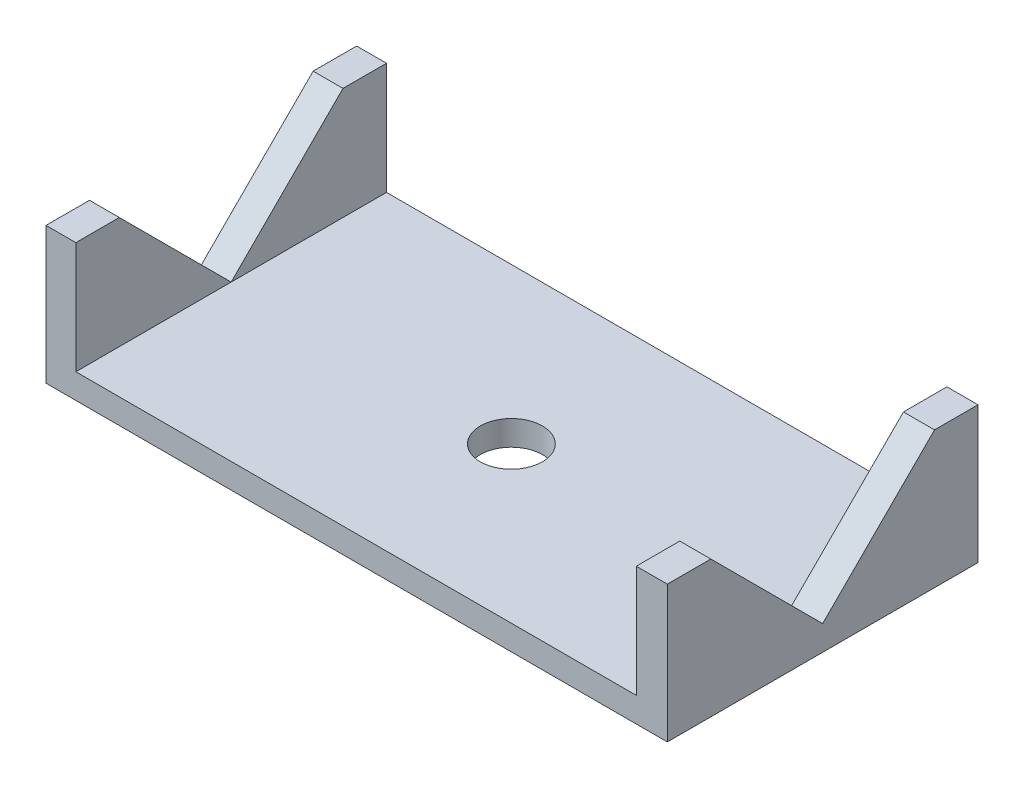
ISO-10303-21;
HEADER;
FILE_DESCRIPTION(('STEP AP214'),'2;1');
FILE_NAME('part.step','',(''),(''),'','','');
FILE_SCHEMA(('AUTOMOTIVE_DESIGN { 1 0 10303 214 1 1 1 1 }'));
ENDSEC;
DATA;
#1=APPLICATION_CONTEXT('core data for automotive mechanical design processes');
#2=APPLICATION_PROTOCOL_DEFINITION('international standard','automotive_design',2000,#1);
#3=PRODUCT_CONTEXT('',#1,'mechanical');
#4=PRODUCT('Part','Part','',(#3));
#5=PRODUCT_RELATED_PRODUCT_CATEGORY('part','',(#4));
#6=PRODUCT_DEFINITION_FORMATION('','',#4);
#7=PRODUCT_DEFINITION_CONTEXT('part definition',#1,'design');
#8=PRODUCT_DEFINITION('design','',#6,#7);
#9=PRODUCT_DEFINITION_SHAPE('','',#8);
#10=(LENGTH_UNIT() NAMED_UNIT(*) SI_UNIT(.MILLI.,.METRE.));
#11=(NAMED_UNIT(*) PLANE_ANGLE_UNIT() SI_UNIT($,.RADIAN.));
#12=(NAMED_UNIT(*) SI_UNIT($,.STERADIAN.) SOLID_ANGLE_UNIT());
#13=UNCERTAINTY_MEASURE_WITH_UNIT(LENGTH_MEASURE(1.E-05),#10,'distance_accuracy_value','');
#14=(GEOMETRIC_REPRESENTATION_CONTEXT(3) GLOBAL_UNCERTAINTY_ASSIGNED_CONTEXT((#13)) GLOBAL_UNIT_ASSIGNED_CONTEXT((#10,
#11,#12)) REPRESENTATION_CONTEXT('',''));
#15=CARTESIAN_POINT('',(0.,0.,0.));
#16=DIRECTION('',(0.,0.,1.));
#17=DIRECTION('',(1.,0.,0.));
#18=AXIS2_PLACEMENT_3D('',#15,#16,#17);
#19=CARTESIAN_POINT('',(22.5,11.,12.5));
#20=DIRECTION('',(1.,0.,0.));
#21=DIRECTION('',(0.,0.,-1.));
#22=AXIS2_PLACEMENT_3D('',#19,#20,#21);
#23=PLANE('',#22);
#24=DIRECTION('',(0.,0.,1.));
#25=VECTOR('',#24,1.);
#26=CARTESIAN_POINT('',(22.5,11.,12.5));
#27=LINE('',#26,#25);
#28=CARTESIAN_POINT('',(22.5,11.,9.00000000000002));
#29=VERTEX_POINT('',#28);
#30=CARTESIAN_POINT('',(22.5,11.,12.5));
#31=VERTEX_POINT('',#30);
#32=EDGE_CURVE('E151',#29,#31,#27,.T.);
#33=ORIENTED_EDGE('',*,*,#32,.F.);
#34=DIRECTION('',(0.,0.707106781186547,0.707106781186548));
#35=VECTOR('',#34,1.);
#36=CARTESIAN_POINT('',(22.5,11.,9.00000000000002));
#37=LINE('',#36,#35);
#38=CARTESIAN_POINT('',(22.5,2.,0.));
#39=VERTEX_POINT('',#38);
#40=EDGE_CURVE('E136',#39,#29,#37,.T.);
#41=ORIENTED_EDGE('',*,*,#40,.F.);
#42=DIRECTION('',(0.,0.,1.));
#43=VECTOR('',#42,1.);
#44=CARTESIAN_POINT('',(22.5,2.,12.5));
#45=LINE('',#44,#43);
#46=CARTESIAN_POINT('',(22.5,2.,12.5));
#47=VERTEX_POINT('',#46);
#48=EDGE_CURVE('E169',#39,#47,#45,.T.);
#49=ORIENTED_EDGE('',*,*,#48,.T.);
#50=DIRECTION('',(0.,-1.,0.));
#51=VECTOR('',#50,1.);
#52=CARTESIAN_POINT('',(22.5,11.,12.5));
#53=LINE('',#52,#51);
#54=EDGE_CURVE('E156',#31,#47,#53,.T.);
#55=ORIENTED_EDGE('',*,*,#54,.F.);
#56=EDGE_LOOP('',(#33,#41,#49,#55));
#57=FACE_BOUND('',#56,.T.);
#58=ADVANCED_FACE('F35',(#57),#23,.F.);
#59=CARTESIAN_POINT('',(0.,11.,0.));
#60=DIRECTION('',(0.,1.,0.));
#61=DIRECTION('',(0.,0.,1.));
#62=AXIS2_PLACEMENT_3D('',#59,#60,#61);
#63=PLANE('',#62);
#64=DIRECTION('',(1.,0.,0.));
#65=VECTOR('',#64,1.);
#66=CARTESIAN_POINT('',(0.,11.,9.00000000000002));
#67=LINE('',#66,#65);
#68=CARTESIAN_POINT('',(25.,11.,9.00000000000002));
#69=VERTEX_POINT('',#68);
#70=EDGE_CURVE('E11',#29,#69,#67,.T.);
#71=ORIENTED_EDGE('',*,*,#70,.F.);
#72=ORIENTED_EDGE('',*,*,#32,.T.);
#73=DIRECTION('',(1.,0.,0.));
#74=VECTOR('',#73,1.);
#75=CARTESIAN_POINT('',(25.,11.,12.5));
#76=LINE('',#75,#74);
#77=CARTESIAN_POINT('',(25.,11.,12.5));
#78=VERTEX_POINT('',#77);
#79=EDGE_CURVE('E162',#31,#78,#76,.T.);
#80=ORIENTED_EDGE('',*,*,#79,.T.);
#81=DIRECTION('',(0.,0.,-1.));
#82=VECTOR('',#81,1.);
#83=CARTESIAN_POINT('',(25.,11.,12.5));
#84=LINE('',#83,#82);
#85=EDGE_CURVE('E154',#78,#69,#84,.T.);
#86=ORIENTED_EDGE('',*,*,#85,.T.);
#87=EDGE_LOOP('',(#71,#72,#80,#86));
#88=FACE_BOUND('',#87,.T.);
#89=ADVANCED_FACE('F149',(#88),#63,.T.);
#90=CARTESIAN_POINT('',(0.,2.,0.));
#91=DIRECTION('',(0.,-1.,0.));
#92=DIRECTION('',(0.,0.,-1.));
#93=AXIS2_PLACEMENT_3D('',#90,#91,#92);
#94=PLANE('',#93);
#95=CARTESIAN_POINT('',(-0.0500000000000049,2.,0.));
#96=DIRECTION('',(0.,1.,0.));
#97=DIRECTION('',(0.,0.,1.));
#98=AXIS2_PLACEMENT_3D('',#95,#96,#97);
#99=CIRCLE('',#98,2.5);
#100=CARTESIAN_POINT('',(-0.0500000000000049,2.,2.5));
#101=VERTEX_POINT('',#100);
#102=EDGE_CURVE('E296',#101,#101,#99,.T.);
#103=ORIENTED_EDGE('',*,*,#102,.F.);
#104=EDGE_LOOP('',(#103));
#105=FACE_BOUND('',#104,.T.);
#106=CARTESIAN_POINT('',(22.5,2.,-12.5));
#107=VERTEX_POINT('',#106);
#108=EDGE_CURVE('E58',#107,#39,#45,.T.);
#109=ORIENTED_EDGE('',*,*,#108,.F.);
#110=DIRECTION('',(-1.,0.,0.));
#111=VECTOR('',#110,1.);
#112=CARTESIAN_POINT('',(-25.,2.,-12.5));
#113=LINE('',#112,#111);
#114=CARTESIAN_POINT('',(-22.6,2.,-12.5));
#115=VERTEX_POINT('',#114);
#116=EDGE_CURVE('E217',#107,#115,#113,.T.);
#117=ORIENTED_EDGE('',*,*,#116,.T.);
#118=DIRECTION('',(0.,0.,-1.));
#119=VECTOR('',#118,1.);
#120=CARTESIAN_POINT('',(-22.6,2.,12.5));
#121=LINE('',#120,#119);
#122=CARTESIAN_POINT('',(-22.6,2.,0.));
#123=VERTEX_POINT('',#122);
#124=EDGE_CURVE('E187',#123,#115,#121,.T.);
#125=ORIENTED_EDGE('',*,*,#124,.F.);
#126=CARTESIAN_POINT('',(-22.6,2.,12.5));
#127=VERTEX_POINT('',#126);
#128=EDGE_CURVE('E208',#127,#123,#121,.T.);
#129=ORIENTED_EDGE('',*,*,#128,.F.);
#130=DIRECTION('',(1.,0.,0.));
#131=VECTOR('',#130,1.);
#132=CARTESIAN_POINT('',(-25.,2.,12.5));
#133=LINE('',#132,#131);
#134=EDGE_CURVE('E218',#127,#47,#133,.T.);
#135=ORIENTED_EDGE('',*,*,#134,.T.);
#136=ORIENTED_EDGE('',*,*,#48,.F.);
#137=EDGE_LOOP('',(#109,#117,#125,#129,#135,#136));
#138=FACE_BOUND('',#137,.T.);
#139=ADVANCED_FACE('F251',(#105,#138),#94,.F.);
#140=CARTESIAN_POINT('',(-22.6,11.,12.5));
#141=DIRECTION('',(-1.,0.,0.));
#142=DIRECTION('',(0.,0.,1.));
#143=AXIS2_PLACEMENT_3D('',#140,#141,#142);
#144=PLANE('',#143);
#145=DIRECTION('',(0.,0.,-1.));
#146=VECTOR('',#145,1.);
#147=CARTESIAN_POINT('',(-22.6,11.,12.5));
#148=LINE('',#147,#146);
#149=CARTESIAN_POINT('',(-22.6,11.,-8.99999999999994));
#150=VERTEX_POINT('',#149);
#151=CARTESIAN_POINT('',(-22.6,11.,-12.5));
#152=VERTEX_POINT('',#151);
#153=EDGE_CURVE('E194',#150,#152,#148,.T.);
#154=ORIENTED_EDGE('',*,*,#153,.F.);
#155=DIRECTION('',(0.,0.70710678118655,-0.707106781186545));
#156=VECTOR('',#155,1.);
#157=CARTESIAN_POINT('',(-22.6,2.,0.));
#158=LINE('',#157,#156);
#159=EDGE_CURVE('E177',#123,#150,#158,.T.);
#160=ORIENTED_EDGE('',*,*,#159,.F.);
#161=ORIENTED_EDGE('',*,*,#124,.T.);
#162=DIRECTION('',(0.,-1.,0.));
#163=VECTOR('',#162,1.);
#164=CARTESIAN_POINT('',(-22.6,11.,-12.5));
#165=LINE('',#164,#163);
#166=EDGE_CURVE('E201',#152,#115,#165,.T.);
#167=ORIENTED_EDGE('',*,*,#166,.F.);
#168=EDGE_LOOP('',(#154,#160,#161,#167));
#169=FACE_BOUND('',#168,.T.);
#170=ADVANCED_FACE('F247',(#169),#144,.F.);
#171=CARTESIAN_POINT('',(0.,11.,0.));
#172=DIRECTION('',(0.,-1.,0.));
#173=DIRECTION('',(0.,0.,-1.));
#174=AXIS2_PLACEMENT_3D('',#171,#172,#173);
#175=PLANE('',#174);
#176=DIRECTION('',(0.,0.,1.));
#177=VECTOR('',#176,1.);
#178=CARTESIAN_POINT('',(-25.,11.,12.5));
#179=LINE('',#178,#177);
#180=CARTESIAN_POINT('',(-25.,11.,-12.5));
#181=VERTEX_POINT('',#180);
#182=CARTESIAN_POINT('',(-25.,11.,-8.99999999999994));
#183=VERTEX_POINT('',#182);
#184=EDGE_CURVE('E188',#181,#183,#179,.T.);
#185=ORIENTED_EDGE('',*,*,#184,.T.);
#186=DIRECTION('',(1.,0.,0.));
#187=VECTOR('',#186,1.);
#188=CARTESIAN_POINT('',(0.,11.,-8.99999999999994));
#189=LINE('',#188,#187);
#190=EDGE_CURVE('E215',#183,#150,#189,.T.);
#191=ORIENTED_EDGE('',*,*,#190,.T.);
#192=ORIENTED_EDGE('',*,*,#153,.T.);
#193=DIRECTION('',(-1.,0.,0.));
#194=VECTOR('',#193,1.);
#195=CARTESIAN_POINT('',(-25.,11.,-12.5));
#196=LINE('',#195,#194);
#197=EDGE_CURVE('E198',#152,#181,#196,.T.);
#198=ORIENTED_EDGE('',*,*,#197,.T.);
#199=EDGE_LOOP('',(#185,#191,#192,#198));
#200=FACE_BOUND('',#199,.T.);
#201=ADVANCED_FACE('F316',(#200),#175,.F.);
#202=CARTESIAN_POINT('',(25.,2.,12.5));
#203=DIRECTION('',(-1.,0.,0.));
#204=DIRECTION('',(0.,0.,1.));
#205=AXIS2_PLACEMENT_3D('',#202,#203,#204);
#206=PLANE('',#205);
#207=DIRECTION('',(0.,-0.707106781186551,0.707106781186544));
#208=VECTOR('',#207,1.);
#209=CARTESIAN_POINT('',(25.,-4.25,6.24999999999993));
#210=LINE('',#209,#208);
#211=CARTESIAN_POINT('',(25.,11.,-8.9999999999999));
#212=VERTEX_POINT('',#211);
#213=CARTESIAN_POINT('',(25.,2.,0.));
#214=VERTEX_POINT('',#213);
#215=EDGE_CURVE('E50',#212,#214,#210,.T.);
#216=ORIENTED_EDGE('',*,*,#215,.T.);
#217=DIRECTION('',(0.,0.707106781186547,0.707106781186548));
#218=VECTOR('',#217,1.);
#219=CARTESIAN_POINT('',(25.,8.25,6.25000000000001));
#220=LINE('',#219,#218);
#221=EDGE_CURVE('E290',#214,#69,#220,.T.);
#222=ORIENTED_EDGE('',*,*,#221,.T.);
#223=ORIENTED_EDGE('',*,*,#85,.F.);
#224=DIRECTION('',(0.,-1.,0.));
#225=VECTOR('',#224,1.);
#226=CARTESIAN_POINT('',(25.,2.,12.5));
#227=LINE('',#226,#225);
#228=CARTESIAN_POINT('',(25.,0.,12.5));
#229=VERTEX_POINT('',#228);
#230=EDGE_CURVE('E271',#78,#229,#227,.T.);
#231=ORIENTED_EDGE('',*,*,#230,.T.);
#232=DIRECTION('',(0.,0.,-1.));
#233=VECTOR('',#232,1.);
#234=CARTESIAN_POINT('',(25.,0.,12.5));
#235=LINE('',#234,#233);
#236=CARTESIAN_POINT('',(25.,0.,-12.5));
#237=VERTEX_POINT('',#236);
#238=EDGE_CURVE('E238',#229,#237,#235,.T.);
#239=ORIENTED_EDGE('',*,*,#238,.T.);
#240=DIRECTION('',(0.,-1.,0.));
#241=VECTOR('',#240,1.);
#242=CARTESIAN_POINT('',(25.,2.,-12.5));
#243=LINE('',#242,#241);
#244=CARTESIAN_POINT('',(25.,11.,-12.5));
#245=VERTEX_POINT('',#244);
#246=EDGE_CURVE('E226',#245,#237,#243,.T.);
#247=ORIENTED_EDGE('',*,*,#246,.F.);
#248=EDGE_CURVE('E168',#212,#245,#84,.T.);
#249=ORIENTED_EDGE('',*,*,#248,.F.);
#250=EDGE_LOOP('',(#216,#222,#223,#231,#239,#247,#249));
#251=FACE_BOUND('',#250,.T.);
#252=ADVANCED_FACE('F37',(#251),#206,.F.);
#253=CARTESIAN_POINT('',(-25.,2.,-12.5));
#254=DIRECTION('',(0.,0.,1.));
#255=DIRECTION('',(1.,0.,0.));
#256=AXIS2_PLACEMENT_3D('',#253,#254,#255);
#257=PLANE('',#256);
#258=DIRECTION('',(-1.,0.,0.));
#259=VECTOR('',#258,1.);
#260=CARTESIAN_POINT('',(-25.,0.,-12.5));
#261=LINE('',#260,#259);
#262=CARTESIAN_POINT('',(-25.,0.,-12.5));
#263=VERTEX_POINT('',#262);
#264=EDGE_CURVE('E281',#237,#263,#261,.T.);
#265=ORIENTED_EDGE('',*,*,#264,.T.);
#266=DIRECTION('',(0.,-1.,0.));
#267=VECTOR('',#266,1.);
#268=CARTESIAN_POINT('',(-25.,2.,-12.5));
#269=LINE('',#268,#267);
#270=EDGE_CURVE('E230',#181,#263,#269,.T.);
#271=ORIENTED_EDGE('',*,*,#270,.F.);
#272=ORIENTED_EDGE('',*,*,#197,.F.);
#273=ORIENTED_EDGE('',*,*,#166,.T.);
#274=ORIENTED_EDGE('',*,*,#116,.F.);
#275=DIRECTION('',(0.,-1.,0.));
#276=VECTOR('',#275,1.);
#277=CARTESIAN_POINT('',(22.5,11.,-12.5));
#278=LINE('',#277,#276);
#279=CARTESIAN_POINT('',(22.5,11.,-12.5));
#280=VERTEX_POINT('',#279);
#281=EDGE_CURVE('E171',#280,#107,#278,.T.);
#282=ORIENTED_EDGE('',*,*,#281,.F.);
#283=DIRECTION('',(-1.,0.,0.));
#284=VECTOR('',#283,1.);
#285=CARTESIAN_POINT('',(25.,11.,-12.5));
#286=LINE('',#285,#284);
#287=EDGE_CURVE('E159',#245,#280,#286,.T.);
#288=ORIENTED_EDGE('',*,*,#287,.F.);
#289=ORIENTED_EDGE('',*,*,#246,.T.);
#290=EDGE_LOOP('',(#265,#271,#272,#273,#274,#282,#288,#289));
#291=FACE_BOUND('',#290,.T.);
#292=ADVANCED_FACE('F244',(#291),#257,.F.);
#293=CARTESIAN_POINT('',(-25.,2.,12.5));
#294=DIRECTION('',(1.,0.,0.));
#295=DIRECTION('',(0.,0.,-1.));
#296=AXIS2_PLACEMENT_3D('',#293,#294,#295);
#297=PLANE('',#296);
#298=DIRECTION('',(0.,-0.707106781186545,-0.70710678118655));
#299=VECTOR('',#298,1.);
#300=CARTESIAN_POINT('',(-25.,8.25,6.25000000000004));
#301=LINE('',#300,#299);
#302=CARTESIAN_POINT('',(-25.,11.,9.00000000000005));
#303=VERTEX_POINT('',#302);
#304=CARTESIAN_POINT('',(-25.,2.,0.));
#305=VERTEX_POINT('',#304);
#306=EDGE_CURVE('E181',#303,#305,#301,.T.);
#307=ORIENTED_EDGE('',*,*,#306,.T.);
#308=DIRECTION('',(0.,0.70710678118655,-0.707106781186545));
#309=VECTOR('',#308,1.);
#310=CARTESIAN_POINT('',(-25.,-4.25,6.24999999999996));
#311=LINE('',#310,#309);
#312=EDGE_CURVE('E184',#305,#183,#311,.T.);
#313=ORIENTED_EDGE('',*,*,#312,.T.);
#314=ORIENTED_EDGE('',*,*,#184,.F.);
#315=ORIENTED_EDGE('',*,*,#270,.T.);
#316=DIRECTION('',(0.,0.,1.));
#317=VECTOR('',#316,1.);
#318=CARTESIAN_POINT('',(-25.,0.,12.5));
#319=LINE('',#318,#317);
#320=CARTESIAN_POINT('',(-25.,0.,12.5));
#321=VERTEX_POINT('',#320);
#322=EDGE_CURVE('E268',#263,#321,#319,.T.);
#323=ORIENTED_EDGE('',*,*,#322,.T.);
#324=DIRECTION('',(0.,-1.,0.));
#325=VECTOR('',#324,1.);
#326=CARTESIAN_POINT('',(-25.,2.,12.5));
#327=LINE('',#326,#325);
#328=CARTESIAN_POINT('',(-25.,11.,12.5));
#329=VERTEX_POINT('',#328);
#330=EDGE_CURVE('E264',#329,#321,#327,.T.);
#331=ORIENTED_EDGE('',*,*,#330,.F.);
#332=EDGE_CURVE('E192',#303,#329,#179,.T.);
#333=ORIENTED_EDGE('',*,*,#332,.F.);
#334=EDGE_LOOP('',(#307,#313,#314,#315,#323,#331,#333));
#335=FACE_BOUND('',#334,.T.);
#336=ADVANCED_FACE('F265',(#335),#297,.F.);
#337=CARTESIAN_POINT('',(-25.,2.,12.5));
#338=DIRECTION('',(0.,0.,-1.));
#339=DIRECTION('',(-1.,0.,0.));
#340=AXIS2_PLACEMENT_3D('',#337,#338,#339);
#341=PLANE('',#340);
#342=DIRECTION('',(1.,0.,0.));
#343=VECTOR('',#342,1.);
#344=CARTESIAN_POINT('',(-25.,0.,12.5));
#345=LINE('',#344,#343);
#346=EDGE_CURVE('E219',#321,#229,#345,.T.);
#347=ORIENTED_EDGE('',*,*,#346,.T.);
#348=ORIENTED_EDGE('',*,*,#230,.F.);
#349=ORIENTED_EDGE('',*,*,#79,.F.);
#350=ORIENTED_EDGE('',*,*,#54,.T.);
#351=ORIENTED_EDGE('',*,*,#134,.F.);
#352=DIRECTION('',(0.,-1.,0.));
#353=VECTOR('',#352,1.);
#354=CARTESIAN_POINT('',(-22.6,11.,12.5));
#355=LINE('',#354,#353);
#356=CARTESIAN_POINT('',(-22.6,11.,12.5));
#357=VERTEX_POINT('',#356);
#358=EDGE_CURVE('E235',#357,#127,#355,.T.);
#359=ORIENTED_EDGE('',*,*,#358,.F.);
#360=DIRECTION('',(1.,0.,0.));
#361=VECTOR('',#360,1.);
#362=CARTESIAN_POINT('',(-25.,11.,12.5));
#363=LINE('',#362,#361);
#364=EDGE_CURVE('E191',#329,#357,#363,.T.);
#365=ORIENTED_EDGE('',*,*,#364,.F.);
#366=ORIENTED_EDGE('',*,*,#330,.T.);
#367=EDGE_LOOP('',(#347,#348,#349,#350,#351,#359,#365,#366));
#368=FACE_BOUND('',#367,.T.);
#369=ADVANCED_FACE('F273',(#368),#341,.F.);
#370=CARTESIAN_POINT('',(0.,0.,0.));
#371=DIRECTION('',(0.,-1.,0.));
#372=DIRECTION('',(0.,0.,-1.));
#373=AXIS2_PLACEMENT_3D('',#370,#371,#372);
#374=PLANE('',#373);
#375=CARTESIAN_POINT('',(-0.0500000000000049,0.,0.));
#376=DIRECTION('',(0.,1.,0.));
#377=DIRECTION('',(0.,0.,1.));
#378=AXIS2_PLACEMENT_3D('',#375,#376,#377);
#379=CIRCLE('',#378,2.5);
#380=CARTESIAN_POINT('',(-0.0500000000000049,0.,2.5));
#381=VERTEX_POINT('',#380);
#382=EDGE_CURVE('E145',#381,#381,#379,.T.);
#383=ORIENTED_EDGE('',*,*,#382,.T.);
#384=EDGE_LOOP('',(#383));
#385=FACE_BOUND('',#384,.T.);
#386=ORIENTED_EDGE('',*,*,#238,.F.);
#387=ORIENTED_EDGE('',*,*,#346,.F.);
#388=ORIENTED_EDGE('',*,*,#322,.F.);
#389=ORIENTED_EDGE('',*,*,#264,.F.);
#390=EDGE_LOOP('',(#386,#387,#388,#389));
#391=FACE_BOUND('',#390,.T.);
#392=ADVANCED_FACE('F287',(#385,#391),#374,.T.);
#393=ORIENTED_EDGE('',*,*,#128,.T.);
#394=DIRECTION('',(0.,-0.707106781186545,-0.70710678118655));
#395=VECTOR('',#394,1.);
#396=CARTESIAN_POINT('',(-22.6,11.,9.00000000000005));
#397=LINE('',#396,#395);
#398=CARTESIAN_POINT('',(-22.6,11.,9.00000000000005));
#399=VERTEX_POINT('',#398);
#400=EDGE_CURVE('E174',#399,#123,#397,.T.);
#401=ORIENTED_EDGE('',*,*,#400,.F.);
#402=EDGE_CURVE('E195',#357,#399,#148,.T.);
#403=ORIENTED_EDGE('',*,*,#402,.F.);
#404=ORIENTED_EDGE('',*,*,#358,.T.);
#405=EDGE_LOOP('',(#393,#401,#403,#404));
#406=FACE_BOUND('',#405,.T.);
#407=ADVANCED_FACE('F256',(#406),#144,.F.);
#408=ORIENTED_EDGE('',*,*,#402,.T.);
#409=DIRECTION('',(-1.,0.,0.));
#410=VECTOR('',#409,1.);
#411=CARTESIAN_POINT('',(0.,11.,9.00000000000005));
#412=LINE('',#411,#410);
#413=EDGE_CURVE('E222',#399,#303,#412,.T.);
#414=ORIENTED_EDGE('',*,*,#413,.T.);
#415=ORIENTED_EDGE('',*,*,#332,.T.);
#416=ORIENTED_EDGE('',*,*,#364,.T.);
#417=EDGE_LOOP('',(#408,#414,#415,#416));
#418=FACE_BOUND('',#417,.T.);
#419=ADVANCED_FACE('F260',(#418),#175,.F.);
#420=CARTESIAN_POINT('',(-31.6,2.,0.));
#421=DIRECTION('',(0.,-0.707106781186545,-0.70710678118655));
#422=DIRECTION('',(0.,0.70710678118655,-0.707106781186545));
#423=AXIS2_PLACEMENT_3D('',#420,#421,#422);
#424=PLANE('',#423);
#425=DIRECTION('',(1.,0.,0.));
#426=VECTOR('',#425,1.);
#427=CARTESIAN_POINT('',(-31.6,2.,0.));
#428=LINE('',#427,#426);
#429=EDGE_CURVE('E179',#305,#123,#428,.T.);
#430=ORIENTED_EDGE('',*,*,#429,.T.);
#431=ORIENTED_EDGE('',*,*,#159,.T.);
#432=ORIENTED_EDGE('',*,*,#190,.F.);
#433=ORIENTED_EDGE('',*,*,#312,.F.);
#434=EDGE_LOOP('',(#430,#431,#432,#433));
#435=FACE_BOUND('',#434,.T.);
#436=ADVANCED_FACE('F335',(#435),#424,.F.);
#437=CARTESIAN_POINT('',(-31.6,11.,9.00000000000005));
#438=DIRECTION('',(0.,-0.70710678118655,0.707106781186545));
#439=DIRECTION('',(0.,-0.707106781186545,-0.70710678118655));
#440=AXIS2_PLACEMENT_3D('',#437,#438,#439);
#441=PLANE('',#440);
#442=ORIENTED_EDGE('',*,*,#413,.F.);
#443=ORIENTED_EDGE('',*,*,#400,.T.);
#444=ORIENTED_EDGE('',*,*,#429,.F.);
#445=ORIENTED_EDGE('',*,*,#306,.F.);
#446=EDGE_LOOP('',(#442,#443,#444,#445));
#447=FACE_BOUND('',#446,.T.);
#448=ADVANCED_FACE('F328',(#447),#441,.F.);
#449=ORIENTED_EDGE('',*,*,#108,.T.);
#450=DIRECTION('',(0.,-0.707106781186551,0.707106781186544));
#451=VECTOR('',#450,1.);
#452=CARTESIAN_POINT('',(22.5,2.,0.));
#453=LINE('',#452,#451);
#454=CARTESIAN_POINT('',(22.5,11.,-8.9999999999999));
#455=VERTEX_POINT('',#454);
#456=EDGE_CURVE('E144',#455,#39,#453,.T.);
#457=ORIENTED_EDGE('',*,*,#456,.F.);
#458=EDGE_CURVE('E158',#280,#455,#27,.T.);
#459=ORIENTED_EDGE('',*,*,#458,.F.);
#460=ORIENTED_EDGE('',*,*,#281,.T.);
#461=EDGE_LOOP('',(#449,#457,#459,#460));
#462=FACE_BOUND('',#461,.T.);
#463=ADVANCED_FACE('F323',(#462),#23,.F.);
#464=DIRECTION('',(-1.,0.,0.));
#465=VECTOR('',#464,1.);
#466=CARTESIAN_POINT('',(0.,11.,-8.9999999999999));
#467=LINE('',#466,#465);
#468=EDGE_CURVE('E43',#212,#455,#467,.T.);
#469=ORIENTED_EDGE('',*,*,#468,.F.);
#470=ORIENTED_EDGE('',*,*,#248,.T.);
#471=ORIENTED_EDGE('',*,*,#287,.T.);
#472=ORIENTED_EDGE('',*,*,#458,.T.);
#473=EDGE_LOOP('',(#469,#470,#471,#472));
#474=FACE_BOUND('',#473,.T.);
#475=ADVANCED_FACE('F319',(#474),#63,.T.);
#476=CARTESIAN_POINT('',(31.5,11.,9.00000000000002));
#477=DIRECTION('',(0.,-0.707106781186548,0.707106781186547));
#478=DIRECTION('',(0.,-0.707106781186547,-0.707106781186548));
#479=AXIS2_PLACEMENT_3D('',#476,#477,#478);
#480=PLANE('',#479);
#481=DIRECTION('',(-1.,0.,0.));
#482=VECTOR('',#481,1.);
#483=CARTESIAN_POINT('',(31.5,2.,0.));
#484=LINE('',#483,#482);
#485=EDGE_CURVE('E140',#214,#39,#484,.T.);
#486=ORIENTED_EDGE('',*,*,#485,.T.);
#487=ORIENTED_EDGE('',*,*,#40,.T.);
#488=ORIENTED_EDGE('',*,*,#70,.T.);
#489=ORIENTED_EDGE('',*,*,#221,.F.);
#490=EDGE_LOOP('',(#486,#487,#488,#489));
#491=FACE_BOUND('',#490,.T.);
#492=ADVANCED_FACE('F138',(#491),#480,.F.);
#493=CARTESIAN_POINT('',(31.5,2.,0.));
#494=DIRECTION('',(0.,-0.707106781186544,-0.707106781186551));
#495=DIRECTION('',(0.,0.707106781186551,-0.707106781186544));
#496=AXIS2_PLACEMENT_3D('',#493,#494,#495);
#497=PLANE('',#496);
#498=ORIENTED_EDGE('',*,*,#468,.T.);
#499=ORIENTED_EDGE('',*,*,#456,.T.);
#500=ORIENTED_EDGE('',*,*,#485,.F.);
#501=ORIENTED_EDGE('',*,*,#215,.F.);
#502=EDGE_LOOP('',(#498,#499,#500,#501));
#503=FACE_BOUND('',#502,.T.);
#504=ADVANCED_FACE('F306',(#503),#497,.F.);
#505=CARTESIAN_POINT('',(-0.0500000000000049,0.,0.));
#506=DIRECTION('',(0.,1.,0.));
#507=DIRECTION('',(0.,0.,1.));
#508=AXIS2_PLACEMENT_3D('',#505,#506,#507);
#509=CYLINDRICAL_SURFACE('',#508,2.5);
#510=ORIENTED_EDGE('',*,*,#382,.F.);
#511=EDGE_LOOP('',(#510));
#512=FACE_BOUND('',#511,.T.);
#513=ORIENTED_EDGE('',*,*,#102,.T.);
#514=EDGE_LOOP('',(#513));
#515=FACE_BOUND('',#514,.T.);
#516=ADVANCED_FACE('F303',(#512,#515),#509,.F.);
#517=CLOSED_SHELL('',(#58,#89,#139,#170,#201,#252,#292,#336,#369,#392,#407,#419,#436,#448,#463,
#475,#492,#504,#516));
#518=MANIFOLD_SOLID_BREP('B2',#517);
#519=ADVANCED_BREP_SHAPE_REPRESENTATION('',(#18,#518),#14);
#520=SHAPE_DEFINITION_REPRESENTATION(#9,#519);
ENDSEC;
END-ISO-10303-21;
